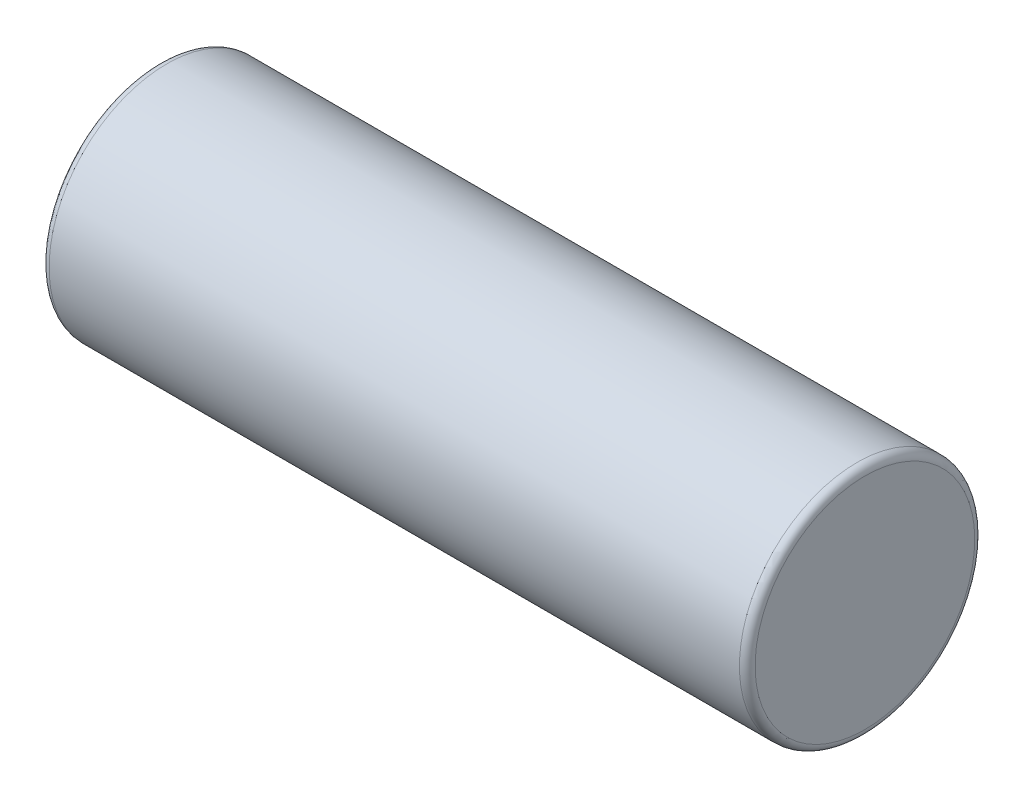
ISO-10303-21;
HEADER;
FILE_DESCRIPTION(('STEP AP214'),'2;1');
FILE_NAME('part.step','',(''),(''),'','','');
FILE_SCHEMA(('AUTOMOTIVE_DESIGN { 1 0 10303 214 1 1 1 1 }'));
ENDSEC;
DATA;
#1=APPLICATION_CONTEXT('core data for automotive mechanical design processes');
#2=APPLICATION_PROTOCOL_DEFINITION('international standard','automotive_design',2000,#1);
#3=PRODUCT_CONTEXT('',#1,'mechanical');
#4=PRODUCT('Part','Part','',(#3));
#5=PRODUCT_RELATED_PRODUCT_CATEGORY('part','',(#4));
#6=PRODUCT_DEFINITION_FORMATION('','',#4);
#7=PRODUCT_DEFINITION_CONTEXT('part definition',#1,'design');
#8=PRODUCT_DEFINITION('design','',#6,#7);
#9=PRODUCT_DEFINITION_SHAPE('','',#8);
#10=(LENGTH_UNIT() NAMED_UNIT(*) SI_UNIT(.MILLI.,.METRE.));
#11=(NAMED_UNIT(*) PLANE_ANGLE_UNIT() SI_UNIT($,.RADIAN.));
#12=(NAMED_UNIT(*) SI_UNIT($,.STERADIAN.) SOLID_ANGLE_UNIT());
#13=UNCERTAINTY_MEASURE_WITH_UNIT(LENGTH_MEASURE(1.E-05),#10,'distance_accuracy_value','');
#14=(GEOMETRIC_REPRESENTATION_CONTEXT(3) GLOBAL_UNCERTAINTY_ASSIGNED_CONTEXT((#13)) GLOBAL_UNIT_ASSIGNED_CONTEXT((#10,
#11,#12)) REPRESENTATION_CONTEXT('',''));
#15=CARTESIAN_POINT('',(0.,0.,0.));
#16=DIRECTION('',(0.,0.,1.));
#17=DIRECTION('',(1.,0.,0.));
#18=AXIS2_PLACEMENT_3D('',#15,#16,#17);
#19=CARTESIAN_POINT('',(9.,0.,0.));
#20=DIRECTION('',(-1.,0.,0.));
#21=DIRECTION('',(0.,0.,1.));
#22=AXIS2_PLACEMENT_3D('',#19,#20,#21);
#23=CYLINDRICAL_SURFACE('',#22,3.);
#24=CARTESIAN_POINT('',(-8.8,0.,0.));
#25=DIRECTION('',(1.,0.,0.));
#26=DIRECTION('',(0.,0.,-1.));
#27=AXIS2_PLACEMENT_3D('',#24,#25,#26);
#28=CIRCLE('',#27,3.);
#29=CARTESIAN_POINT('',(-8.8,0.,-3.));
#30=VERTEX_POINT('',#29);
#31=EDGE_CURVE('E50',#30,#30,#28,.T.);
#32=ORIENTED_EDGE('',*,*,#31,.T.);
#33=EDGE_LOOP('',(#32));
#34=FACE_BOUND('',#33,.T.);
#35=CARTESIAN_POINT('',(8.8,0.,0.));
#36=DIRECTION('',(1.,0.,0.));
#37=DIRECTION('',(0.,0.,-1.));
#38=AXIS2_PLACEMENT_3D('',#35,#36,#37);
#39=CIRCLE('',#38,3.);
#40=CARTESIAN_POINT('',(8.8,0.,-3.));
#41=VERTEX_POINT('',#40);
#42=EDGE_CURVE('E55',#41,#41,#39,.F.);
#43=ORIENTED_EDGE('',*,*,#42,.T.);
#44=EDGE_LOOP('',(#43));
#45=FACE_BOUND('',#44,.T.);
#46=ADVANCED_FACE('F37',(#34,#45),#23,.T.);
#47=CARTESIAN_POINT('',(9.,0.,0.));
#48=DIRECTION('',(1.,0.,0.));
#49=DIRECTION('',(0.,0.,-1.));
#50=AXIS2_PLACEMENT_3D('',#47,#48,#49);
#51=PLANE('',#50);
#52=CARTESIAN_POINT('',(9.,0.,0.));
#53=DIRECTION('',(1.,0.,0.));
#54=DIRECTION('',(0.,0.,-1.));
#55=AXIS2_PLACEMENT_3D('',#52,#53,#54);
#56=CIRCLE('',#55,2.8);
#57=CARTESIAN_POINT('',(9.,0.,-2.8));
#58=VERTEX_POINT('',#57);
#59=EDGE_CURVE('E10',#58,#58,#56,.T.);
#60=ORIENTED_EDGE('',*,*,#59,.T.);
#61=EDGE_LOOP('',(#60));
#62=FACE_BOUND('',#61,.T.);
#63=ADVANCED_FACE('F72',(#62),#51,.T.);
#64=CARTESIAN_POINT('',(-9.,0.,0.));
#65=DIRECTION('',(1.,0.,0.));
#66=DIRECTION('',(0.,0.,-1.));
#67=AXIS2_PLACEMENT_3D('',#64,#65,#66);
#68=PLANE('',#67);
#69=CARTESIAN_POINT('',(-9.,0.,0.));
#70=DIRECTION('',(1.,0.,0.));
#71=DIRECTION('',(0.,0.,-1.));
#72=AXIS2_PLACEMENT_3D('',#69,#70,#71);
#73=CIRCLE('',#72,2.8);
#74=CARTESIAN_POINT('',(-9.,0.,-2.8));
#75=VERTEX_POINT('',#74);
#76=EDGE_CURVE('E45',#75,#75,#73,.F.);
#77=ORIENTED_EDGE('',*,*,#76,.T.);
#78=EDGE_LOOP('',(#77));
#79=FACE_BOUND('',#78,.T.);
#80=ADVANCED_FACE('F69',(#79),#68,.F.);
#81=CARTESIAN_POINT('',(-8.8,0.,0.));
#82=DIRECTION('',(1.,0.,0.));
#83=DIRECTION('',(0.,0.,-1.));
#84=AXIS2_PLACEMENT_3D('',#81,#82,#83);
#85=TOROIDAL_SURFACE('',#84,2.8,0.2);
#86=ORIENTED_EDGE('',*,*,#76,.F.);
#87=EDGE_LOOP('',(#86));
#88=FACE_BOUND('',#87,.T.);
#89=ORIENTED_EDGE('',*,*,#31,.F.);
#90=EDGE_LOOP('',(#89));
#91=FACE_BOUND('',#90,.T.);
#92=ADVANCED_FACE('F65',(#88,#91),#85,.T.);
#93=CARTESIAN_POINT('',(8.8,0.,0.));
#94=DIRECTION('',(1.,0.,0.));
#95=DIRECTION('',(0.,0.,-1.));
#96=AXIS2_PLACEMENT_3D('',#93,#94,#95);
#97=TOROIDAL_SURFACE('',#96,2.8,0.2);
#98=ORIENTED_EDGE('',*,*,#42,.F.);
#99=EDGE_LOOP('',(#98));
#100=FACE_BOUND('',#99,.T.);
#101=ORIENTED_EDGE('',*,*,#59,.F.);
#102=EDGE_LOOP('',(#101));
#103=FACE_BOUND('',#102,.T.);
#104=ADVANCED_FACE('F39',(#100,#103),#97,.T.);
#105=CLOSED_SHELL('',(#46,#63,#80,#92,#104));
#106=MANIFOLD_SOLID_BREP('B2',#105);
#107=ADVANCED_BREP_SHAPE_REPRESENTATION('',(#18,#106),#14);
#108=SHAPE_DEFINITION_REPRESENTATION(#9,#107);
ENDSEC;
END-ISO-10303-21;
